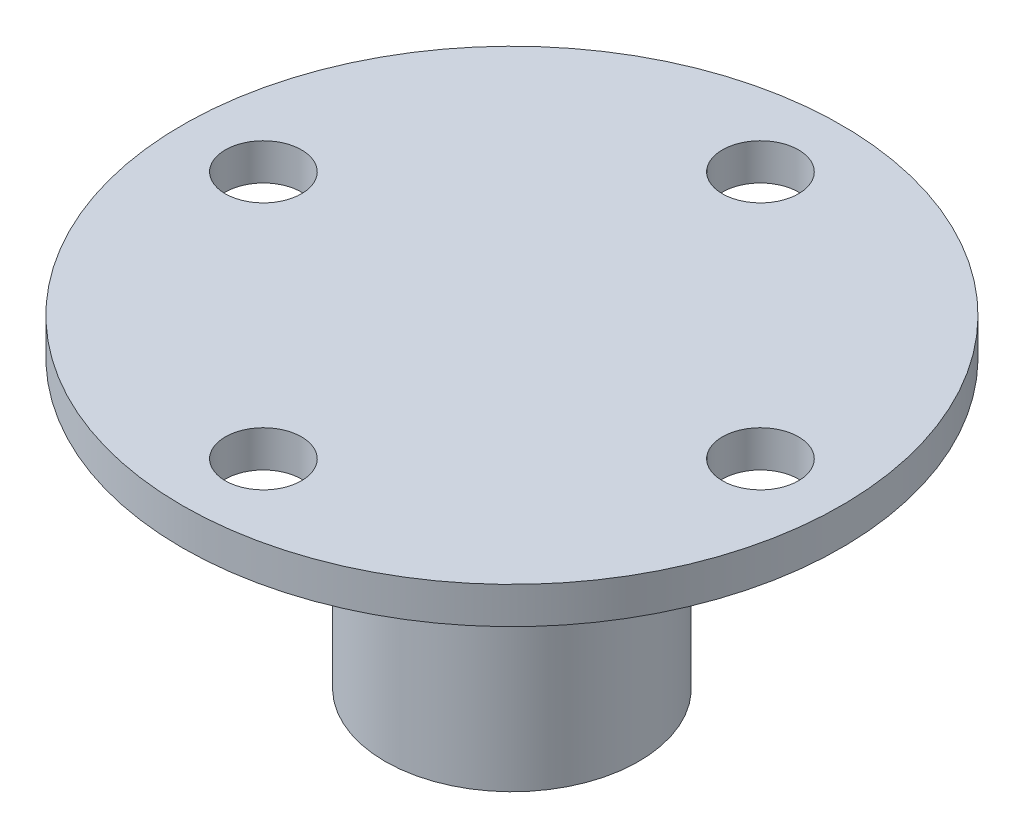
ISO-10303-21;
HEADER;
FILE_DESCRIPTION(('STEP AP214'),'2;1');
FILE_NAME('part.step','',(''),(''),'','','');
FILE_SCHEMA(('AUTOMOTIVE_DESIGN { 1 0 10303 214 1 1 1 1 }'));
ENDSEC;
DATA;
#1=APPLICATION_CONTEXT('core data for automotive mechanical design processes');
#2=APPLICATION_PROTOCOL_DEFINITION('international standard','automotive_design',2000,#1);
#3=PRODUCT_CONTEXT('',#1,'mechanical');
#4=PRODUCT('Part','Part','',(#3));
#5=PRODUCT_RELATED_PRODUCT_CATEGORY('part','',(#4));
#6=PRODUCT_DEFINITION_FORMATION('','',#4);
#7=PRODUCT_DEFINITION_CONTEXT('part definition',#1,'design');
#8=PRODUCT_DEFINITION('design','',#6,#7);
#9=PRODUCT_DEFINITION_SHAPE('','',#8);
#10=(LENGTH_UNIT() NAMED_UNIT(*) SI_UNIT(.MILLI.,.METRE.));
#11=(NAMED_UNIT(*) PLANE_ANGLE_UNIT() SI_UNIT($,.RADIAN.));
#12=(NAMED_UNIT(*) SI_UNIT($,.STERADIAN.) SOLID_ANGLE_UNIT());
#13=UNCERTAINTY_MEASURE_WITH_UNIT(LENGTH_MEASURE(1.E-05),#10,'distance_accuracy_value','');
#14=(GEOMETRIC_REPRESENTATION_CONTEXT(3) GLOBAL_UNCERTAINTY_ASSIGNED_CONTEXT((#13)) GLOBAL_UNIT_ASSIGNED_CONTEXT((#10,
#11,#12)) REPRESENTATION_CONTEXT('',''));
#15=CARTESIAN_POINT('',(0.,0.,0.));
#16=DIRECTION('',(0.,0.,1.));
#17=DIRECTION('',(1.,0.,0.));
#18=AXIS2_PLACEMENT_3D('',#15,#16,#17);
#19=CARTESIAN_POINT('',(0.,3.175,21.548));
#20=DIRECTION('',(0.,-1.,0.));
#21=DIRECTION('',(0.,0.,-1.));
#22=AXIS2_PLACEMENT_3D('',#19,#20,#21);
#23=CYLINDRICAL_SURFACE('',#22,3.302);
#24=CARTESIAN_POINT('',(0.,3.175,21.548));
#25=DIRECTION('',(0.,1.,0.));
#26=DIRECTION('',(0.,0.,1.));
#27=AXIS2_PLACEMENT_3D('',#24,#25,#26);
#28=CIRCLE('',#27,3.302);
#29=CARTESIAN_POINT('',(0.,3.175,24.85));
#30=VERTEX_POINT('',#29);
#31=EDGE_CURVE('E57',#30,#30,#28,.T.);
#32=ORIENTED_EDGE('',*,*,#31,.T.);
#33=EDGE_LOOP('',(#32));
#34=FACE_BOUND('',#33,.T.);
#35=CARTESIAN_POINT('',(0.,0.,21.548));
#36=DIRECTION('',(0.,1.,0.));
#37=DIRECTION('',(0.,0.,1.));
#38=AXIS2_PLACEMENT_3D('',#35,#36,#37);
#39=CIRCLE('',#38,3.302);
#40=CARTESIAN_POINT('',(0.,0.,24.85));
#41=VERTEX_POINT('',#40);
#42=EDGE_CURVE('E174',#41,#41,#39,.T.);
#43=ORIENTED_EDGE('',*,*,#42,.F.);
#44=EDGE_LOOP('',(#43));
#45=FACE_BOUND('',#44,.T.);
#46=ADVANCED_FACE('F47',(#34,#45),#23,.F.);
#47=CARTESIAN_POINT('',(-21.548,3.175,-1.50468879778784E-13));
#48=DIRECTION('',(0.,-1.,0.));
#49=DIRECTION('',(0.,0.,-1.));
#50=AXIS2_PLACEMENT_3D('',#47,#48,#49);
#51=CYLINDRICAL_SURFACE('',#50,3.302);
#52=CARTESIAN_POINT('',(-21.548,3.175,-1.50468879778784E-13));
#53=DIRECTION('',(0.,1.,0.));
#54=DIRECTION('',(0.,0.,1.));
#55=AXIS2_PLACEMENT_3D('',#52,#53,#54);
#56=CIRCLE('',#55,3.302);
#57=CARTESIAN_POINT('',(-21.548,3.175,3.30199999999985));
#58=VERTEX_POINT('',#57);
#59=EDGE_CURVE('E157',#58,#58,#56,.T.);
#60=ORIENTED_EDGE('',*,*,#59,.T.);
#61=EDGE_LOOP('',(#60));
#62=FACE_BOUND('',#61,.T.);
#63=CARTESIAN_POINT('',(-21.548,0.,-1.50468879778784E-13));
#64=DIRECTION('',(0.,1.,0.));
#65=DIRECTION('',(0.,0.,1.));
#66=AXIS2_PLACEMENT_3D('',#63,#64,#65);
#67=CIRCLE('',#66,3.302);
#68=CARTESIAN_POINT('',(-21.548,0.,3.30199999999985));
#69=VERTEX_POINT('',#68);
#70=EDGE_CURVE('E171',#69,#69,#67,.T.);
#71=ORIENTED_EDGE('',*,*,#70,.F.);
#72=EDGE_LOOP('',(#71));
#73=FACE_BOUND('',#72,.T.);
#74=ADVANCED_FACE('F203',(#62,#73),#51,.F.);
#75=CARTESIAN_POINT('',(2.25703319668175E-13,3.175,-21.548));
#76=DIRECTION('',(0.,-1.,0.));
#77=DIRECTION('',(0.,0.,-1.));
#78=AXIS2_PLACEMENT_3D('',#75,#76,#77);
#79=CYLINDRICAL_SURFACE('',#78,3.302);
#80=CARTESIAN_POINT('',(2.25703319668175E-13,3.175,-21.548));
#81=DIRECTION('',(0.,1.,0.));
#82=DIRECTION('',(0.,0.,1.));
#83=AXIS2_PLACEMENT_3D('',#80,#81,#82);
#84=CIRCLE('',#83,3.302);
#85=CARTESIAN_POINT('',(2.25703319668175E-13,3.175,-18.246));
#86=VERTEX_POINT('',#85);
#87=EDGE_CURVE('E153',#86,#86,#84,.T.);
#88=ORIENTED_EDGE('',*,*,#87,.T.);
#89=EDGE_LOOP('',(#88));
#90=FACE_BOUND('',#89,.T.);
#91=CARTESIAN_POINT('',(2.25703319668175E-13,0.,-21.548));
#92=DIRECTION('',(0.,1.,0.));
#93=DIRECTION('',(0.,0.,1.));
#94=AXIS2_PLACEMENT_3D('',#91,#92,#93);
#95=CIRCLE('',#94,3.302);
#96=CARTESIAN_POINT('',(2.25703319668175E-13,0.,-18.246));
#97=VERTEX_POINT('',#96);
#98=EDGE_CURVE('E167',#97,#97,#95,.T.);
#99=ORIENTED_EDGE('',*,*,#98,.F.);
#100=EDGE_LOOP('',(#99));
#101=FACE_BOUND('',#100,.T.);
#102=ADVANCED_FACE('F209',(#90,#101),#79,.F.);
#103=CARTESIAN_POINT('',(21.548,3.175,0.));
#104=DIRECTION('',(0.,-1.,0.));
#105=DIRECTION('',(0.,0.,-1.));
#106=AXIS2_PLACEMENT_3D('',#103,#104,#105);
#107=CYLINDRICAL_SURFACE('',#106,3.302);
#108=CARTESIAN_POINT('',(21.548,3.175,0.));
#109=DIRECTION('',(0.,1.,0.));
#110=DIRECTION('',(0.,0.,1.));
#111=AXIS2_PLACEMENT_3D('',#108,#109,#110);
#112=CIRCLE('',#111,3.302);
#113=CARTESIAN_POINT('',(21.548,3.175,3.302));
#114=VERTEX_POINT('',#113);
#115=EDGE_CURVE('E149',#114,#114,#112,.T.);
#116=ORIENTED_EDGE('',*,*,#115,.T.);
#117=EDGE_LOOP('',(#116));
#118=FACE_BOUND('',#117,.T.);
#119=CARTESIAN_POINT('',(21.548,0.,0.));
#120=DIRECTION('',(0.,1.,0.));
#121=DIRECTION('',(0.,0.,1.));
#122=AXIS2_PLACEMENT_3D('',#119,#120,#121);
#123=CIRCLE('',#122,3.302);
#124=CARTESIAN_POINT('',(21.548,0.,3.302));
#125=VERTEX_POINT('',#124);
#126=EDGE_CURVE('E143',#125,#125,#123,.T.);
#127=ORIENTED_EDGE('',*,*,#126,.F.);
#128=EDGE_LOOP('',(#127));
#129=FACE_BOUND('',#128,.T.);
#130=ADVANCED_FACE('F49',(#118,#129),#107,.F.);
#131=CARTESIAN_POINT('',(0.,3.175,0.));
#132=DIRECTION('',(0.,-1.,0.));
#133=DIRECTION('',(0.,0.,-1.));
#134=AXIS2_PLACEMENT_3D('',#131,#132,#133);
#135=CYLINDRICAL_SURFACE('',#134,28.575);
#136=CARTESIAN_POINT('',(0.,3.175,0.));
#137=DIRECTION('',(0.,1.,0.));
#138=DIRECTION('',(0.,0.,1.));
#139=AXIS2_PLACEMENT_3D('',#136,#137,#138);
#140=CIRCLE('',#139,28.575);
#141=CARTESIAN_POINT('',(0.,3.175,28.575));
#142=VERTEX_POINT('',#141);
#143=EDGE_CURVE('E11',#142,#142,#140,.T.);
#144=ORIENTED_EDGE('',*,*,#143,.F.);
#145=EDGE_LOOP('',(#144));
#146=FACE_BOUND('',#145,.T.);
#147=CARTESIAN_POINT('',(0.,0.,0.));
#148=DIRECTION('',(0.,1.,0.));
#149=DIRECTION('',(0.,0.,1.));
#150=AXIS2_PLACEMENT_3D('',#147,#148,#149);
#151=CIRCLE('',#150,28.575);
#152=CARTESIAN_POINT('',(0.,0.,28.575));
#153=VERTEX_POINT('',#152);
#154=EDGE_CURVE('E51',#153,#153,#151,.T.);
#155=ORIENTED_EDGE('',*,*,#154,.T.);
#156=EDGE_LOOP('',(#155));
#157=FACE_BOUND('',#156,.T.);
#158=ADVANCED_FACE('F183',(#146,#157),#135,.T.);
#159=CARTESIAN_POINT('',(0.,3.175,0.));
#160=DIRECTION('',(0.,1.,0.));
#161=DIRECTION('',(0.,0.,1.));
#162=AXIS2_PLACEMENT_3D('',#159,#160,#161);
#163=PLANE('',#162);
#164=ORIENTED_EDGE('',*,*,#115,.F.);
#165=EDGE_LOOP('',(#164));
#166=FACE_BOUND('',#165,.T.);
#167=ORIENTED_EDGE('',*,*,#87,.F.);
#168=EDGE_LOOP('',(#167));
#169=FACE_BOUND('',#168,.T.);
#170=ORIENTED_EDGE('',*,*,#59,.F.);
#171=EDGE_LOOP('',(#170));
#172=FACE_BOUND('',#171,.T.);
#173=ORIENTED_EDGE('',*,*,#31,.F.);
#174=EDGE_LOOP('',(#173));
#175=FACE_BOUND('',#174,.T.);
#176=ORIENTED_EDGE('',*,*,#143,.T.);
#177=EDGE_LOOP('',(#176));
#178=FACE_BOUND('',#177,.T.);
#179=ADVANCED_FACE('F187',(#166,#169,#172,#175,#178),#163,.T.);
#180=CARTESIAN_POINT('',(0.,0.,0.));
#181=DIRECTION('',(0.,1.,0.));
#182=DIRECTION('',(0.,0.,1.));
#183=AXIS2_PLACEMENT_3D('',#180,#181,#182);
#184=PLANE('',#183);
#185=CARTESIAN_POINT('',(0.,0.,0.));
#186=DIRECTION('',(0.,1.,0.));
#187=DIRECTION('',(0.,0.,1.));
#188=AXIS2_PLACEMENT_3D('',#185,#186,#187);
#189=CIRCLE('',#188,11.);
#190=CARTESIAN_POINT('',(0.,0.,11.));
#191=VERTEX_POINT('',#190);
#192=EDGE_CURVE('E128',#191,#191,#189,.T.);
#193=ORIENTED_EDGE('',*,*,#192,.T.);
#194=EDGE_LOOP('',(#193));
#195=FACE_BOUND('',#194,.T.);
#196=ORIENTED_EDGE('',*,*,#126,.T.);
#197=EDGE_LOOP('',(#196));
#198=FACE_BOUND('',#197,.T.);
#199=ORIENTED_EDGE('',*,*,#98,.T.);
#200=EDGE_LOOP('',(#199));
#201=FACE_BOUND('',#200,.T.);
#202=ORIENTED_EDGE('',*,*,#70,.T.);
#203=EDGE_LOOP('',(#202));
#204=FACE_BOUND('',#203,.T.);
#205=ORIENTED_EDGE('',*,*,#42,.T.);
#206=EDGE_LOOP('',(#205));
#207=FACE_BOUND('',#206,.T.);
#208=ORIENTED_EDGE('',*,*,#154,.F.);
#209=EDGE_LOOP('',(#208));
#210=FACE_BOUND('',#209,.T.);
#211=ADVANCED_FACE('F185',(#195,#198,#201,#204,#207,#210),#184,.F.);
#212=CARTESIAN_POINT('',(0.,-24.825,0.));
#213=DIRECTION('',(0.,1.,0.));
#214=DIRECTION('',(0.,0.,1.));
#215=AXIS2_PLACEMENT_3D('',#212,#213,#214);
#216=CYLINDRICAL_SURFACE('',#215,6.);
#217=CARTESIAN_POINT('',(0.,0.,0.));
#218=DIRECTION('',(0.,1.,0.));
#219=DIRECTION('',(0.,0.,1.));
#220=AXIS2_PLACEMENT_3D('',#217,#218,#219);
#221=CIRCLE('',#220,6.);
#222=CARTESIAN_POINT('',(-2.5857864376269,0.,5.4142135623731));
#223=VERTEX_POINT('',#222);
#224=CARTESIAN_POINT('',(-5.41421356237311,0.,2.58578643762691));
#225=VERTEX_POINT('',#224);
#226=EDGE_CURVE('E132',#223,#225,#221,.T.);
#227=ORIENTED_EDGE('',*,*,#226,.T.);
#228=DIRECTION('',(0.,1.,0.));
#229=VECTOR('',#228,1.);
#230=CARTESIAN_POINT('',(-5.41421356237311,-24.825,2.58578643762691));
#231=LINE('',#230,#229);
#232=CARTESIAN_POINT('',(-5.41421356237311,-24.825,2.58578643762691));
#233=VERTEX_POINT('',#232);
#234=EDGE_CURVE('E115',#233,#225,#231,.T.);
#235=ORIENTED_EDGE('',*,*,#234,.F.);
#236=CARTESIAN_POINT('',(0.,-24.825,0.));
#237=DIRECTION('',(0.,1.,0.));
#238=DIRECTION('',(0.,0.,1.));
#239=AXIS2_PLACEMENT_3D('',#236,#237,#238);
#240=CIRCLE('',#239,6.);
#241=CARTESIAN_POINT('',(-2.5857864376269,-24.825,5.4142135623731));
#242=VERTEX_POINT('',#241);
#243=EDGE_CURVE('E94',#242,#233,#240,.T.);
#244=ORIENTED_EDGE('',*,*,#243,.F.);
#245=DIRECTION('',(0.,1.,0.));
#246=VECTOR('',#245,1.);
#247=CARTESIAN_POINT('',(-2.5857864376269,-24.825,5.4142135623731));
#248=LINE('',#247,#246);
#249=EDGE_CURVE('E105',#242,#223,#248,.T.);
#250=ORIENTED_EDGE('',*,*,#249,.T.);
#251=EDGE_LOOP('',(#227,#235,#244,#250));
#252=FACE_BOUND('',#251,.T.);
#253=ADVANCED_FACE('F114',(#252),#216,.F.);
#254=CARTESIAN_POINT('',(-1.41421356237311,-24.825,-1.4142135623731));
#255=DIRECTION('',(0.707106781186548,0.,0.707106781186547));
#256=DIRECTION('',(0.707106781186547,0.,-0.707106781186548));
#257=AXIS2_PLACEMENT_3D('',#254,#255,#256);
#258=PLANE('',#257);
#259=DIRECTION('',(0.707106781186547,0.,-0.707106781186548));
#260=VECTOR('',#259,1.);
#261=CARTESIAN_POINT('',(-1.41421356237311,0.,-1.4142135623731));
#262=LINE('',#261,#260);
#263=CARTESIAN_POINT('',(-6.71751442127221,0.,3.88908729652601));
#264=VERTEX_POINT('',#263);
#265=EDGE_CURVE('E65',#264,#225,#262,.T.);
#266=ORIENTED_EDGE('',*,*,#265,.F.);
#267=DIRECTION('',(0.,1.,0.));
#268=VECTOR('',#267,1.);
#269=CARTESIAN_POINT('',(-6.71751442127221,-24.825,3.88908729652601));
#270=LINE('',#269,#268);
#271=CARTESIAN_POINT('',(-6.71751442127221,-24.825,3.88908729652601));
#272=VERTEX_POINT('',#271);
#273=EDGE_CURVE('E144',#272,#264,#270,.T.);
#274=ORIENTED_EDGE('',*,*,#273,.F.);
#275=DIRECTION('',(0.707106781186547,0.,-0.707106781186548));
#276=VECTOR('',#275,1.);
#277=CARTESIAN_POINT('',(-1.41421356237311,-24.825,-1.4142135623731));
#278=LINE('',#277,#276);
#279=EDGE_CURVE('E112',#272,#233,#278,.T.);
#280=ORIENTED_EDGE('',*,*,#279,.T.);
#281=ORIENTED_EDGE('',*,*,#234,.T.);
#282=EDGE_LOOP('',(#266,#274,#280,#281));
#283=FACE_BOUND('',#282,.T.);
#284=ADVANCED_FACE('F195',(#283),#258,.T.);
#285=CARTESIAN_POINT('',(-5.30330085889909,-24.825,5.30330085889912));
#286=DIRECTION('',(-0.707106781186546,0.,0.707106781186549));
#287=DIRECTION('',(0.707106781186549,0.,0.707106781186546));
#288=AXIS2_PLACEMENT_3D('',#285,#286,#287);
#289=PLANE('',#288);
#290=DIRECTION('',(0.707106781186549,0.,0.707106781186546));
#291=VECTOR('',#290,1.);
#292=CARTESIAN_POINT('',(-5.30330085889909,0.,5.30330085889912));
#293=LINE('',#292,#291);
#294=CARTESIAN_POINT('',(-3.88908729652601,0.,6.7175144212722));
#295=VERTEX_POINT('',#294);
#296=EDGE_CURVE('E70',#264,#295,#293,.T.);
#297=ORIENTED_EDGE('',*,*,#296,.T.);
#298=DIRECTION('',(0.,1.,0.));
#299=VECTOR('',#298,1.);
#300=CARTESIAN_POINT('',(-3.88908729652601,-24.825,6.7175144212722));
#301=LINE('',#300,#299);
#302=CARTESIAN_POINT('',(-3.88908729652601,-24.825,6.7175144212722));
#303=VERTEX_POINT('',#302);
#304=EDGE_CURVE('E111',#303,#295,#301,.T.);
#305=ORIENTED_EDGE('',*,*,#304,.F.);
#306=DIRECTION('',(0.707106781186549,0.,0.707106781186546));
#307=VECTOR('',#306,1.);
#308=CARTESIAN_POINT('',(-5.30330085889909,-24.825,5.30330085889912));
#309=LINE('',#308,#307);
#310=EDGE_CURVE('E97',#272,#303,#309,.T.);
#311=ORIENTED_EDGE('',*,*,#310,.F.);
#312=ORIENTED_EDGE('',*,*,#273,.T.);
#313=EDGE_LOOP('',(#297,#305,#311,#312));
#314=FACE_BOUND('',#313,.T.);
#315=ADVANCED_FACE('F276',(#314),#289,.F.);
#316=CARTESIAN_POINT('',(0.,-24.825,0.));
#317=DIRECTION('',(0.,1.,0.));
#318=DIRECTION('',(0.,0.,1.));
#319=AXIS2_PLACEMENT_3D('',#316,#317,#318);
#320=CYLINDRICAL_SURFACE('',#319,11.);
#321=CARTESIAN_POINT('',(0.,-24.825,0.));
#322=DIRECTION('',(0.,1.,0.));
#323=DIRECTION('',(0.,0.,1.));
#324=AXIS2_PLACEMENT_3D('',#321,#322,#323);
#325=CIRCLE('',#324,11.);
#326=CARTESIAN_POINT('',(0.,-24.825,11.));
#327=VERTEX_POINT('',#326);
#328=EDGE_CURVE('E118',#327,#327,#325,.T.);
#329=ORIENTED_EDGE('',*,*,#328,.T.);
#330=EDGE_LOOP('',(#329));
#331=FACE_BOUND('',#330,.T.);
#332=ORIENTED_EDGE('',*,*,#192,.F.);
#333=EDGE_LOOP('',(#332));
#334=FACE_BOUND('',#333,.T.);
#335=ADVANCED_FACE('F286',(#331,#334),#320,.T.);
#336=CARTESIAN_POINT('',(1.4142135623731,-24.825,1.4142135623731));
#337=DIRECTION('',(0.707106781186547,0.,0.707106781186548));
#338=DIRECTION('',(0.707106781186548,0.,-0.707106781186547));
#339=AXIS2_PLACEMENT_3D('',#336,#337,#338);
#340=PLANE('',#339);
#341=DIRECTION('',(0.707106781186548,0.,-0.707106781186547));
#342=VECTOR('',#341,1.);
#343=CARTESIAN_POINT('',(1.4142135623731,0.,1.4142135623731));
#344=LINE('',#343,#342);
#345=EDGE_CURVE('E107',#295,#223,#344,.T.);
#346=ORIENTED_EDGE('',*,*,#345,.T.);
#347=ORIENTED_EDGE('',*,*,#249,.F.);
#348=DIRECTION('',(0.707106781186548,0.,-0.707106781186547));
#349=VECTOR('',#348,1.);
#350=CARTESIAN_POINT('',(1.4142135623731,-24.825,1.4142135623731));
#351=LINE('',#350,#349);
#352=EDGE_CURVE('E89',#303,#242,#351,.T.);
#353=ORIENTED_EDGE('',*,*,#352,.F.);
#354=ORIENTED_EDGE('',*,*,#304,.T.);
#355=EDGE_LOOP('',(#346,#347,#353,#354));
#356=FACE_BOUND('',#355,.T.);
#357=ADVANCED_FACE('F106',(#356),#340,.F.);
#358=CARTESIAN_POINT('',(0.,-24.825,0.));
#359=DIRECTION('',(0.,1.,0.));
#360=DIRECTION('',(0.,0.,1.));
#361=AXIS2_PLACEMENT_3D('',#358,#359,#360);
#362=PLANE('',#361);
#363=ORIENTED_EDGE('',*,*,#328,.F.);
#364=EDGE_LOOP('',(#363));
#365=FACE_BOUND('',#364,.T.);
#366=ORIENTED_EDGE('',*,*,#243,.T.);
#367=ORIENTED_EDGE('',*,*,#279,.F.);
#368=ORIENTED_EDGE('',*,*,#310,.T.);
#369=ORIENTED_EDGE('',*,*,#352,.T.);
#370=EDGE_LOOP('',(#366,#367,#368,#369));
#371=FACE_BOUND('',#370,.T.);
#372=ADVANCED_FACE('F91',(#365,#371),#362,.F.);
#373=ORIENTED_EDGE('',*,*,#226,.F.);
#374=ORIENTED_EDGE('',*,*,#345,.F.);
#375=ORIENTED_EDGE('',*,*,#296,.F.);
#376=ORIENTED_EDGE('',*,*,#265,.T.);
#377=EDGE_LOOP('',(#373,#374,#375,#376));
#378=FACE_BOUND('',#377,.T.);
#379=ADVANCED_FACE('F190',(#378),#184,.F.);
#380=CLOSED_SHELL('',(#46,#74,#102,#130,#158,#179,#211,#253,#284,#315,#335,#357,#372,#379));
#381=MANIFOLD_SOLID_BREP('B2',#380);
#382=ADVANCED_BREP_SHAPE_REPRESENTATION('',(#18,#381),#14);
#383=SHAPE_DEFINITION_REPRESENTATION(#9,#382);
ENDSEC;
END-ISO-10303-21;
